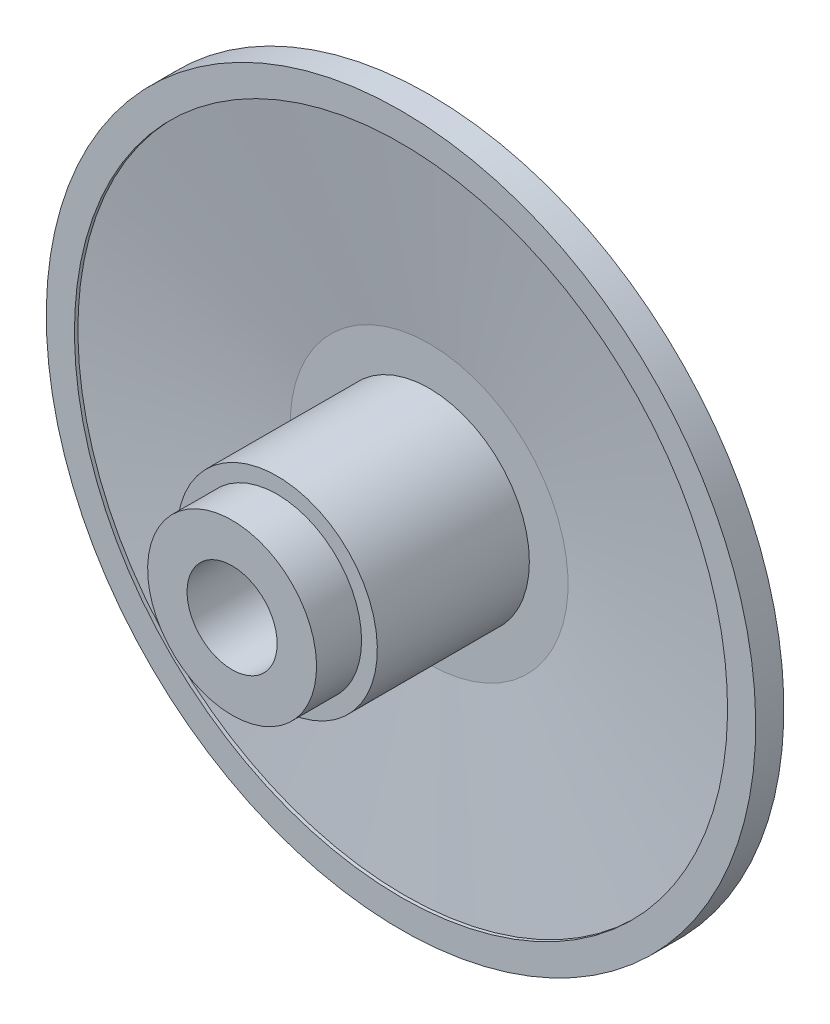
ISO-10303-21;
HEADER;
FILE_DESCRIPTION(('STEP AP214'),'2;1');
FILE_NAME('part.step','',(''),(''),'','','');
FILE_SCHEMA(('AUTOMOTIVE_DESIGN { 1 0 10303 214 1 1 1 1 }'));
ENDSEC;
DATA;
#1=APPLICATION_CONTEXT('core data for automotive mechanical design processes');
#2=APPLICATION_PROTOCOL_DEFINITION('international standard','automotive_design',2000,#1);
#3=PRODUCT_CONTEXT('',#1,'mechanical');
#4=PRODUCT('Part','Part','',(#3));
#5=PRODUCT_RELATED_PRODUCT_CATEGORY('part','',(#4));
#6=PRODUCT_DEFINITION_FORMATION('','',#4);
#7=PRODUCT_DEFINITION_CONTEXT('part definition',#1,'design');
#8=PRODUCT_DEFINITION('design','',#6,#7);
#9=PRODUCT_DEFINITION_SHAPE('','',#8);
#10=(LENGTH_UNIT() NAMED_UNIT(*) SI_UNIT(.MILLI.,.METRE.));
#11=(NAMED_UNIT(*) PLANE_ANGLE_UNIT() SI_UNIT($,.RADIAN.));
#12=(NAMED_UNIT(*) SI_UNIT($,.STERADIAN.) SOLID_ANGLE_UNIT());
#13=UNCERTAINTY_MEASURE_WITH_UNIT(LENGTH_MEASURE(1.E-05),#10,'distance_accuracy_value','');
#14=(GEOMETRIC_REPRESENTATION_CONTEXT(3) GLOBAL_UNCERTAINTY_ASSIGNED_CONTEXT((#13)) GLOBAL_UNIT_ASSIGNED_CONTEXT((#10,
#11,#12)) REPRESENTATION_CONTEXT('',''));
#15=CARTESIAN_POINT('',(0.,0.,0.));
#16=DIRECTION('',(0.,0.,1.));
#17=DIRECTION('',(1.,0.,0.));
#18=AXIS2_PLACEMENT_3D('',#15,#16,#17);
#19=CARTESIAN_POINT('',(0.,0.,0.));
#20=DIRECTION('',(0.,0.,-1.));
#21=DIRECTION('',(0.,1.,0.));
#22=AXIS2_PLACEMENT_3D('',#19,#20,#21);
#23=CYLINDRICAL_SURFACE('',#22,4.);
#24=CARTESIAN_POINT('',(0.,0.,0.));
#25=DIRECTION('',(0.,0.,1.));
#26=DIRECTION('',(0.,-1.,0.));
#27=AXIS2_PLACEMENT_3D('',#24,#25,#26);
#28=CIRCLE('',#27,4.);
#29=CARTESIAN_POINT('',(0.,-4.,0.));
#30=VERTEX_POINT('',#29);
#31=EDGE_CURVE('E11',#30,#30,#28,.T.);
#32=ORIENTED_EDGE('',*,*,#31,.T.);
#33=EDGE_LOOP('',(#32));
#34=FACE_BOUND('',#33,.T.);
#35=CARTESIAN_POINT('',(0.,0.,-20.));
#36=DIRECTION('',(0.,0.,1.));
#37=DIRECTION('',(0.,-1.,0.));
#38=AXIS2_PLACEMENT_3D('',#35,#36,#37);
#39=CIRCLE('',#38,4.);
#40=CARTESIAN_POINT('',(0.,4.,-20.));
#41=VERTEX_POINT('',#40);
#42=EDGE_CURVE('E98',#41,#41,#39,.T.);
#43=ORIENTED_EDGE('',*,*,#42,.F.);
#44=EDGE_LOOP('',(#43));
#45=FACE_BOUND('',#44,.T.);
#46=ADVANCED_FACE('F16',(#34,#45),#23,.F.);
#47=CARTESIAN_POINT('',(0.,0.,-4.));
#48=DIRECTION('',(0.,0.,1.));
#49=DIRECTION('',(0.,-1.,0.));
#50=AXIS2_PLACEMENT_3D('',#47,#48,#49);
#51=CYLINDRICAL_SURFACE('',#50,7.5);
#52=CARTESIAN_POINT('',(0.,0.,-4.));
#53=DIRECTION('',(0.,0.,1.));
#54=DIRECTION('',(0.,-1.,0.));
#55=AXIS2_PLACEMENT_3D('',#52,#53,#54);
#56=CIRCLE('',#55,7.5);
#57=CARTESIAN_POINT('',(0.,7.5,-4.));
#58=VERTEX_POINT('',#57);
#59=EDGE_CURVE('E27',#58,#58,#56,.T.);
#60=ORIENTED_EDGE('',*,*,#59,.T.);
#61=EDGE_LOOP('',(#60));
#62=FACE_BOUND('',#61,.T.);
#63=CARTESIAN_POINT('',(0.,0.,0.));
#64=DIRECTION('',(0.,0.,1.));
#65=DIRECTION('',(0.,-1.,0.));
#66=AXIS2_PLACEMENT_3D('',#63,#64,#65);
#67=CIRCLE('',#66,7.5);
#68=CARTESIAN_POINT('',(0.,-7.5,0.));
#69=VERTEX_POINT('',#68);
#70=EDGE_CURVE('E94',#69,#69,#67,.T.);
#71=ORIENTED_EDGE('',*,*,#70,.F.);
#72=EDGE_LOOP('',(#71));
#73=FACE_BOUND('',#72,.T.);
#74=ADVANCED_FACE('F154',(#62,#73),#51,.T.);
#75=CARTESIAN_POINT('',(0.,0.,-15.0213642611436));
#76=DIRECTION('',(0.,0.,1.));
#77=DIRECTION('',(0.,-1.,0.));
#78=AXIS2_PLACEMENT_3D('',#75,#76,#77);
#79=CONICAL_SURFACE('',#78,31.1738637185715,1.43996893072084);
#80=CARTESIAN_POINT('',(0.,0.,-17.5));
#81=DIRECTION('',(0.,0.,-1.));
#82=DIRECTION('',(0.,-1.,0.));
#83=AXIS2_PLACEMENT_3D('',#80,#81,#82);
#84=CIRCLE('',#83,12.3362321032632);
#85=CARTESIAN_POINT('',(0.,12.3362321032632,-17.5));
#86=VERTEX_POINT('',#85);
#87=EDGE_CURVE('E74',#86,#86,#84,.T.);
#88=ORIENTED_EDGE('',*,*,#87,.T.);
#89=EDGE_LOOP('',(#88));
#90=FACE_BOUND('',#89,.T.);
#91=CARTESIAN_POINT('',(0.,0.,-15.3073989609557));
#92=DIRECTION('',(0.,0.,-1.));
#93=DIRECTION('',(0.,-1.,0.));
#94=AXIS2_PLACEMENT_3D('',#91,#92,#93);
#95=CIRCLE('',#94,29.);
#96=CARTESIAN_POINT('',(0.,-29.,-15.3073989609557));
#97=VERTEX_POINT('',#96);
#98=EDGE_CURVE('E90',#97,#97,#95,.T.);
#99=ORIENTED_EDGE('',*,*,#98,.F.);
#100=EDGE_LOOP('',(#99));
#101=FACE_BOUND('',#100,.T.);
#102=ADVANCED_FACE('F18',(#90,#101),#79,.F.);
#103=CARTESIAN_POINT('',(0.,0.,-15.));
#104=DIRECTION('',(0.,0.,-1.));
#105=DIRECTION('',(0.,1.,0.));
#106=AXIS2_PLACEMENT_3D('',#103,#104,#105);
#107=CYLINDRICAL_SURFACE('',#106,29.);
#108=CARTESIAN_POINT('',(0.,0.,-15.));
#109=DIRECTION('',(0.,0.,1.));
#110=DIRECTION('',(0.,-1.,0.));
#111=AXIS2_PLACEMENT_3D('',#108,#109,#110);
#112=CIRCLE('',#111,29.);
#113=CARTESIAN_POINT('',(0.,-29.,-15.));
#114=VERTEX_POINT('',#113);
#115=EDGE_CURVE('E82',#114,#114,#112,.T.);
#116=ORIENTED_EDGE('',*,*,#115,.T.);
#117=EDGE_LOOP('',(#116));
#118=FACE_BOUND('',#117,.T.);
#119=ORIENTED_EDGE('',*,*,#98,.T.);
#120=EDGE_LOOP('',(#119));
#121=FACE_BOUND('',#120,.T.);
#122=ADVANCED_FACE('F148',(#118,#121),#107,.F.);
#123=CARTESIAN_POINT('',(0.,0.,-17.5));
#124=DIRECTION('',(0.,0.,1.));
#125=DIRECTION('',(0.,-1.,0.));
#126=AXIS2_PLACEMENT_3D('',#123,#124,#125);
#127=CONICAL_SURFACE('',#126,31.5,1.43996893072084);
#128=CARTESIAN_POINT('',(0.,0.,-20.));
#129=DIRECTION('',(0.,0.,-1.));
#130=DIRECTION('',(0.,1.,0.));
#131=AXIS2_PLACEMENT_3D('',#128,#129,#130);
#132=CIRCLE('',#131,12.5);
#133=CARTESIAN_POINT('',(0.,-12.5,-20.));
#134=VERTEX_POINT('',#133);
#135=EDGE_CURVE('E101',#134,#134,#132,.T.);
#136=ORIENTED_EDGE('',*,*,#135,.F.);
#137=EDGE_LOOP('',(#136));
#138=FACE_BOUND('',#137,.T.);
#139=CARTESIAN_POINT('',(0.,0.,-17.5));
#140=DIRECTION('',(0.,0.,-1.));
#141=DIRECTION('',(0.,1.,0.));
#142=AXIS2_PLACEMENT_3D('',#139,#140,#141);
#143=CIRCLE('',#142,31.5);
#144=CARTESIAN_POINT('',(0.,-31.5,-17.5));
#145=VERTEX_POINT('',#144);
#146=EDGE_CURVE('E20',#145,#145,#143,.T.);
#147=ORIENTED_EDGE('',*,*,#146,.T.);
#148=EDGE_LOOP('',(#147));
#149=FACE_BOUND('',#148,.T.);
#150=ADVANCED_FACE('F132',(#138,#149),#127,.T.);
#151=CARTESIAN_POINT('',(0.,0.,-15.));
#152=DIRECTION('',(0.,0.,-1.));
#153=DIRECTION('',(0.,1.,0.));
#154=AXIS2_PLACEMENT_3D('',#151,#152,#153);
#155=CYLINDRICAL_SURFACE('',#154,31.5);
#156=CARTESIAN_POINT('',(0.,0.,-15.));
#157=DIRECTION('',(0.,0.,1.));
#158=DIRECTION('',(0.,-1.,0.));
#159=AXIS2_PLACEMENT_3D('',#156,#157,#158);
#160=CIRCLE('',#159,31.5);
#161=CARTESIAN_POINT('',(0.,31.5,-15.));
#162=VERTEX_POINT('',#161);
#163=EDGE_CURVE('E91',#162,#162,#160,.T.);
#164=ORIENTED_EDGE('',*,*,#163,.F.);
#165=EDGE_LOOP('',(#164));
#166=FACE_BOUND('',#165,.T.);
#167=ORIENTED_EDGE('',*,*,#146,.F.);
#168=EDGE_LOOP('',(#167));
#169=FACE_BOUND('',#168,.T.);
#170=ADVANCED_FACE('F136',(#166,#169),#155,.T.);
#171=CARTESIAN_POINT('',(0.,0.,-42.6730014102411));
#172=DIRECTION('',(0.,0.,1.));
#173=DIRECTION('',(0.,-1.,0.));
#174=AXIS2_PLACEMENT_3D('',#171,#172,#173);
#175=CYLINDRICAL_SURFACE('',#174,8.9);
#176=CARTESIAN_POINT('',(0.,0.,-17.5));
#177=DIRECTION('',(0.,0.,1.));
#178=DIRECTION('',(0.,-1.,0.));
#179=AXIS2_PLACEMENT_3D('',#176,#177,#178);
#180=CIRCLE('',#179,8.9);
#181=CARTESIAN_POINT('',(0.,8.9,-17.5));
#182=VERTEX_POINT('',#181);
#183=EDGE_CURVE('E86',#182,#182,#180,.T.);
#184=ORIENTED_EDGE('',*,*,#183,.T.);
#185=EDGE_LOOP('',(#184));
#186=FACE_BOUND('',#185,.T.);
#187=CARTESIAN_POINT('',(0.,0.,-4.));
#188=DIRECTION('',(0.,0.,-1.));
#189=DIRECTION('',(0.,-1.,0.));
#190=AXIS2_PLACEMENT_3D('',#187,#188,#189);
#191=CIRCLE('',#190,8.9);
#192=CARTESIAN_POINT('',(0.,-8.9,-4.));
#193=VERTEX_POINT('',#192);
#194=EDGE_CURVE('E108',#193,#193,#191,.T.);
#195=ORIENTED_EDGE('',*,*,#194,.T.);
#196=EDGE_LOOP('',(#195));
#197=FACE_BOUND('',#196,.T.);
#198=ADVANCED_FACE('F138',(#186,#197),#175,.T.);
#199=CARTESIAN_POINT('',(0.,0.,-20.));
#200=DIRECTION('',(0.,0.,1.));
#201=DIRECTION('',(1.,0.,0.));
#202=AXIS2_PLACEMENT_3D('',#199,#200,#201);
#203=PLANE('',#202);
#204=ORIENTED_EDGE('',*,*,#135,.T.);
#205=EDGE_LOOP('',(#204));
#206=FACE_BOUND('',#205,.T.);
#207=ORIENTED_EDGE('',*,*,#42,.T.);
#208=EDGE_LOOP('',(#207));
#209=FACE_BOUND('',#208,.T.);
#210=ADVANCED_FACE('F146',(#206,#209),#203,.F.);
#211=CARTESIAN_POINT('',(0.,0.,0.));
#212=DIRECTION('',(0.,0.,1.));
#213=DIRECTION('',(1.,0.,0.));
#214=AXIS2_PLACEMENT_3D('',#211,#212,#213);
#215=PLANE('',#214);
#216=ORIENTED_EDGE('',*,*,#70,.T.);
#217=EDGE_LOOP('',(#216));
#218=FACE_BOUND('',#217,.T.);
#219=ORIENTED_EDGE('',*,*,#31,.F.);
#220=EDGE_LOOP('',(#219));
#221=FACE_BOUND('',#220,.T.);
#222=ADVANCED_FACE('F168',(#218,#221),#215,.T.);
#223=CARTESIAN_POINT('',(0.,0.,-15.));
#224=DIRECTION('',(0.,0.,1.));
#225=DIRECTION('',(1.,0.,0.));
#226=AXIS2_PLACEMENT_3D('',#223,#224,#225);
#227=PLANE('',#226);
#228=ORIENTED_EDGE('',*,*,#163,.T.);
#229=EDGE_LOOP('',(#228));
#230=FACE_BOUND('',#229,.T.);
#231=ORIENTED_EDGE('',*,*,#115,.F.);
#232=EDGE_LOOP('',(#231));
#233=FACE_BOUND('',#232,.T.);
#234=ADVANCED_FACE('F170',(#230,#233),#227,.T.);
#235=CARTESIAN_POINT('',(0.,0.,-17.5));
#236=DIRECTION('',(0.,0.,1.));
#237=DIRECTION('',(1.,0.,0.));
#238=AXIS2_PLACEMENT_3D('',#235,#236,#237);
#239=PLANE('',#238);
#240=ORIENTED_EDGE('',*,*,#87,.F.);
#241=EDGE_LOOP('',(#240));
#242=FACE_BOUND('',#241,.T.);
#243=ORIENTED_EDGE('',*,*,#183,.F.);
#244=EDGE_LOOP('',(#243));
#245=FACE_BOUND('',#244,.T.);
#246=ADVANCED_FACE('F162',(#242,#245),#239,.T.);
#247=CARTESIAN_POINT('',(0.,0.,-4.));
#248=DIRECTION('',(0.,0.,1.));
#249=DIRECTION('',(1.,0.,0.));
#250=AXIS2_PLACEMENT_3D('',#247,#248,#249);
#251=PLANE('',#250);
#252=ORIENTED_EDGE('',*,*,#194,.F.);
#253=EDGE_LOOP('',(#252));
#254=FACE_BOUND('',#253,.T.);
#255=ORIENTED_EDGE('',*,*,#59,.F.);
#256=EDGE_LOOP('',(#255));
#257=FACE_BOUND('',#256,.T.);
#258=ADVANCED_FACE('F71',(#254,#257),#251,.T.);
#259=CLOSED_SHELL('',(#46,#74,#102,#122,#150,#170,#198,#210,#222,#234,#246,#258));
#260=MANIFOLD_SOLID_BREP('B1',#259);
#261=ADVANCED_BREP_SHAPE_REPRESENTATION('',(#18,#260),#14);
#262=SHAPE_DEFINITION_REPRESENTATION(#9,#261);
ENDSEC;
END-ISO-10303-21;
